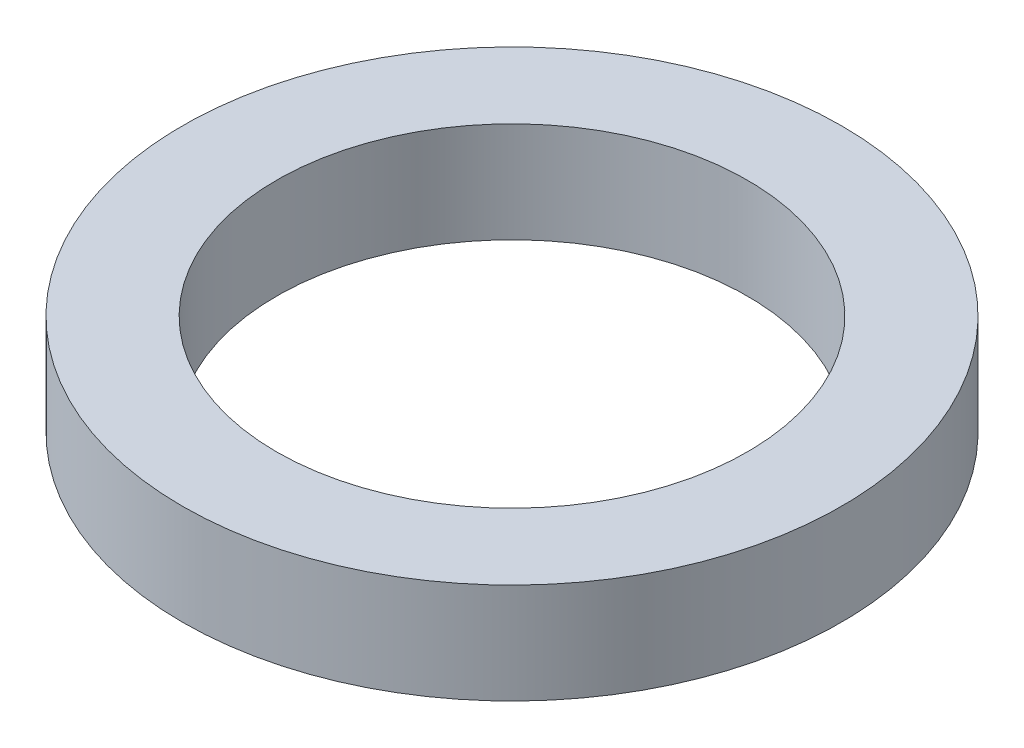
ISO-10303-21;
HEADER;
FILE_DESCRIPTION(('STEP AP214'),'2;1');
FILE_NAME('part.step','',(''),(''),'','','');
FILE_SCHEMA(('AUTOMOTIVE_DESIGN { 1 0 10303 214 1 1 1 1 }'));
ENDSEC;
DATA;
#1=APPLICATION_CONTEXT('core data for automotive mechanical design processes');
#2=APPLICATION_PROTOCOL_DEFINITION('international standard','automotive_design',2000,#1);
#3=PRODUCT_CONTEXT('',#1,'mechanical');
#4=PRODUCT('Part','Part','',(#3));
#5=PRODUCT_RELATED_PRODUCT_CATEGORY('part','',(#4));
#6=PRODUCT_DEFINITION_FORMATION('','',#4);
#7=PRODUCT_DEFINITION_CONTEXT('part definition',#1,'design');
#8=PRODUCT_DEFINITION('design','',#6,#7);
#9=PRODUCT_DEFINITION_SHAPE('','',#8);
#10=(LENGTH_UNIT() NAMED_UNIT(*) SI_UNIT(.MILLI.,.METRE.));
#11=(NAMED_UNIT(*) PLANE_ANGLE_UNIT() SI_UNIT($,.RADIAN.));
#12=(NAMED_UNIT(*) SI_UNIT($,.STERADIAN.) SOLID_ANGLE_UNIT());
#13=UNCERTAINTY_MEASURE_WITH_UNIT(LENGTH_MEASURE(1.E-05),#10,'distance_accuracy_value','');
#14=(GEOMETRIC_REPRESENTATION_CONTEXT(3) GLOBAL_UNCERTAINTY_ASSIGNED_CONTEXT((#13)) GLOBAL_UNIT_ASSIGNED_CONTEXT((#10,
#11,#12)) REPRESENTATION_CONTEXT('',''));
#15=CARTESIAN_POINT('',(0.,0.,0.));
#16=DIRECTION('',(0.,0.,1.));
#17=DIRECTION('',(1.,0.,0.));
#18=AXIS2_PLACEMENT_3D('',#15,#16,#17);
#19=CARTESIAN_POINT('',(0.,16.,0.));
#20=DIRECTION('',(0.,-1.,0.));
#21=DIRECTION('',(0.,0.,-1.));
#22=AXIS2_PLACEMENT_3D('',#19,#20,#21);
#23=CYLINDRICAL_SURFACE('',#22,52.5);
#24=CARTESIAN_POINT('',(0.,16.,0.));
#25=DIRECTION('',(0.,1.,0.));
#26=DIRECTION('',(0.,0.,1.));
#27=AXIS2_PLACEMENT_3D('',#24,#25,#26);
#28=CIRCLE('',#27,52.5);
#29=CARTESIAN_POINT('',(0.,16.,52.5));
#30=VERTEX_POINT('',#29);
#31=EDGE_CURVE('E10',#30,#30,#28,.T.);
#32=ORIENTED_EDGE('',*,*,#31,.F.);
#33=EDGE_LOOP('',(#32));
#34=FACE_BOUND('',#33,.T.);
#35=CARTESIAN_POINT('',(0.,0.,0.));
#36=DIRECTION('',(0.,1.,0.));
#37=DIRECTION('',(0.,0.,1.));
#38=AXIS2_PLACEMENT_3D('',#35,#36,#37);
#39=CIRCLE('',#38,52.5);
#40=CARTESIAN_POINT('',(0.,0.,52.5));
#41=VERTEX_POINT('',#40);
#42=EDGE_CURVE('E37',#41,#41,#39,.T.);
#43=ORIENTED_EDGE('',*,*,#42,.T.);
#44=EDGE_LOOP('',(#43));
#45=FACE_BOUND('',#44,.T.);
#46=ADVANCED_FACE('F40',(#34,#45),#23,.T.);
#47=CARTESIAN_POINT('',(0.,16.,0.));
#48=DIRECTION('',(0.,1.,0.));
#49=DIRECTION('',(0.,0.,1.));
#50=AXIS2_PLACEMENT_3D('',#47,#48,#49);
#51=PLANE('',#50);
#52=CARTESIAN_POINT('',(0.,16.,0.));
#53=DIRECTION('',(0.,1.,0.));
#54=DIRECTION('',(0.,0.,1.));
#55=AXIS2_PLACEMENT_3D('',#52,#53,#54);
#56=CIRCLE('',#55,37.5);
#57=CARTESIAN_POINT('',(0.,16.,37.5));
#58=VERTEX_POINT('',#57);
#59=EDGE_CURVE('E50',#58,#58,#56,.T.);
#60=ORIENTED_EDGE('',*,*,#59,.F.);
#61=EDGE_LOOP('',(#60));
#62=FACE_BOUND('',#61,.T.);
#63=ORIENTED_EDGE('',*,*,#31,.T.);
#64=EDGE_LOOP('',(#63));
#65=FACE_BOUND('',#64,.T.);
#66=ADVANCED_FACE('F59',(#62,#65),#51,.T.);
#67=CARTESIAN_POINT('',(0.,0.,0.));
#68=DIRECTION('',(0.,1.,0.));
#69=DIRECTION('',(0.,0.,1.));
#70=AXIS2_PLACEMENT_3D('',#67,#68,#69);
#71=PLANE('',#70);
#72=CARTESIAN_POINT('',(0.,0.,0.));
#73=DIRECTION('',(0.,1.,0.));
#74=DIRECTION('',(0.,0.,1.));
#75=AXIS2_PLACEMENT_3D('',#72,#73,#74);
#76=CIRCLE('',#75,37.5);
#77=CARTESIAN_POINT('',(0.,0.,37.5));
#78=VERTEX_POINT('',#77);
#79=EDGE_CURVE('E47',#78,#78,#76,.T.);
#80=ORIENTED_EDGE('',*,*,#79,.T.);
#81=EDGE_LOOP('',(#80));
#82=FACE_BOUND('',#81,.T.);
#83=ORIENTED_EDGE('',*,*,#42,.F.);
#84=EDGE_LOOP('',(#83));
#85=FACE_BOUND('',#84,.T.);
#86=ADVANCED_FACE('F58',(#82,#85),#71,.F.);
#87=CARTESIAN_POINT('',(0.,16.,0.));
#88=DIRECTION('',(0.,-1.,0.));
#89=DIRECTION('',(0.,0.,-1.));
#90=AXIS2_PLACEMENT_3D('',#87,#88,#89);
#91=CYLINDRICAL_SURFACE('',#90,37.5);
#92=ORIENTED_EDGE('',*,*,#59,.T.);
#93=EDGE_LOOP('',(#92));
#94=FACE_BOUND('',#93,.T.);
#95=ORIENTED_EDGE('',*,*,#79,.F.);
#96=EDGE_LOOP('',(#95));
#97=FACE_BOUND('',#96,.T.);
#98=ADVANCED_FACE('F54',(#94,#97),#91,.F.);
#99=CLOSED_SHELL('',(#46,#66,#86,#98));
#100=MANIFOLD_SOLID_BREP('B2',#99);
#101=ADVANCED_BREP_SHAPE_REPRESENTATION('',(#18,#100),#14);
#102=SHAPE_DEFINITION_REPRESENTATION(#9,#101);
ENDSEC;
END-ISO-10303-21;
